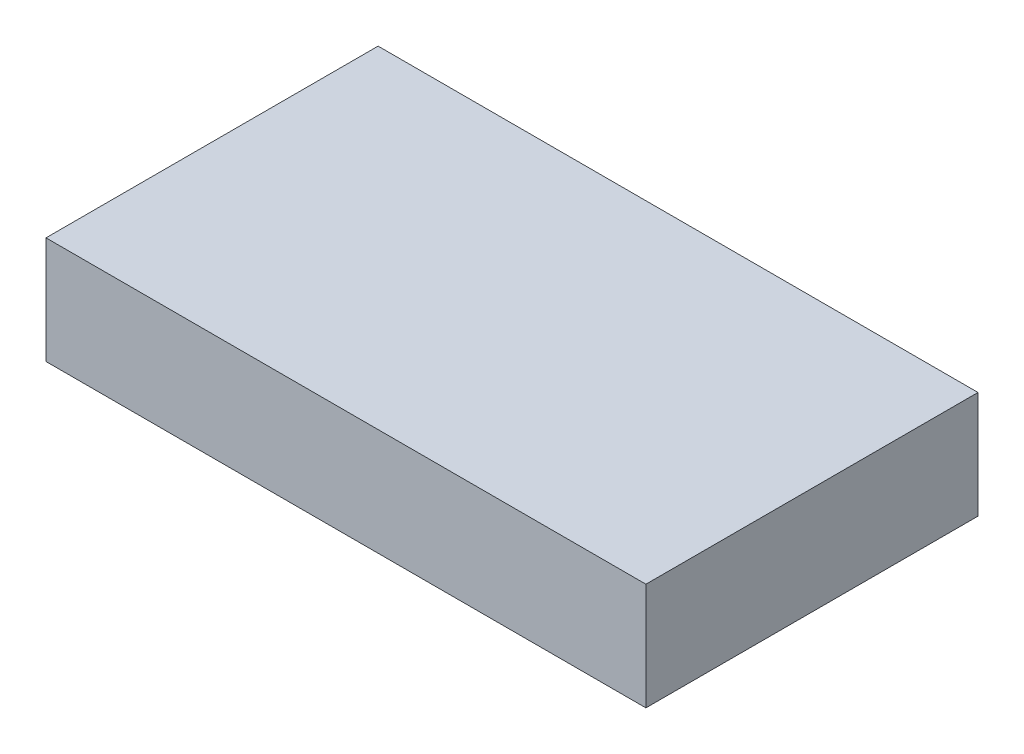
ISO-10303-21;
HEADER;
FILE_DESCRIPTION(('STEP AP214'),'2;1');
FILE_NAME('part.step','',(''),(''),'','','');
FILE_SCHEMA(('AUTOMOTIVE_DESIGN { 1 0 10303 214 1 1 1 1 }'));
ENDSEC;
DATA;
#1=APPLICATION_CONTEXT('core data for automotive mechanical design processes');
#2=APPLICATION_PROTOCOL_DEFINITION('international standard','automotive_design',2000,#1);
#3=PRODUCT_CONTEXT('',#1,'mechanical');
#4=PRODUCT('Part','Part','',(#3));
#5=PRODUCT_RELATED_PRODUCT_CATEGORY('part','',(#4));
#6=PRODUCT_DEFINITION_FORMATION('','',#4);
#7=PRODUCT_DEFINITION_CONTEXT('part definition',#1,'design');
#8=PRODUCT_DEFINITION('design','',#6,#7);
#9=PRODUCT_DEFINITION_SHAPE('','',#8);
#10=(LENGTH_UNIT() NAMED_UNIT(*) SI_UNIT(.MILLI.,.METRE.));
#11=(NAMED_UNIT(*) PLANE_ANGLE_UNIT() SI_UNIT($,.RADIAN.));
#12=(NAMED_UNIT(*) SI_UNIT($,.STERADIAN.) SOLID_ANGLE_UNIT());
#13=UNCERTAINTY_MEASURE_WITH_UNIT(LENGTH_MEASURE(1.E-05),#10,'distance_accuracy_value','');
#14=(GEOMETRIC_REPRESENTATION_CONTEXT(3) GLOBAL_UNCERTAINTY_ASSIGNED_CONTEXT((#13)) GLOBAL_UNIT_ASSIGNED_CONTEXT((#10,
#11,#12)) REPRESENTATION_CONTEXT('',''));
#15=CARTESIAN_POINT('',(0.,0.,0.));
#16=DIRECTION('',(0.,0.,1.));
#17=DIRECTION('',(1.,0.,0.));
#18=AXIS2_PLACEMENT_3D('',#15,#16,#17);
#19=CARTESIAN_POINT('',(28.,10.,15.5));
#20=DIRECTION('',(-1.,0.,0.));
#21=DIRECTION('',(0.,0.,1.));
#22=AXIS2_PLACEMENT_3D('',#19,#20,#21);
#23=PLANE('',#22);
#24=DIRECTION('',(0.,0.,-1.));
#25=VECTOR('',#24,1.);
#26=CARTESIAN_POINT('',(28.,0.,15.5));
#27=LINE('',#26,#25);
#28=CARTESIAN_POINT('',(28.,0.,15.5));
#29=VERTEX_POINT('',#28);
#30=CARTESIAN_POINT('',(28.,0.,-15.5));
#31=VERTEX_POINT('',#30);
#32=EDGE_CURVE('E96',#29,#31,#27,.T.);
#33=ORIENTED_EDGE('',*,*,#32,.T.);
#34=DIRECTION('',(0.,-1.,0.));
#35=VECTOR('',#34,1.);
#36=CARTESIAN_POINT('',(28.,10.,-15.5));
#37=LINE('',#36,#35);
#38=CARTESIAN_POINT('',(28.,10.,-15.5));
#39=VERTEX_POINT('',#38);
#40=EDGE_CURVE('E11',#39,#31,#37,.T.);
#41=ORIENTED_EDGE('',*,*,#40,.F.);
#42=DIRECTION('',(0.,0.,-1.));
#43=VECTOR('',#42,1.);
#44=CARTESIAN_POINT('',(28.,10.,15.5));
#45=LINE('',#44,#43);
#46=CARTESIAN_POINT('',(28.,10.,15.5));
#47=VERTEX_POINT('',#46);
#48=EDGE_CURVE('E84',#47,#39,#45,.T.);
#49=ORIENTED_EDGE('',*,*,#48,.F.);
#50=DIRECTION('',(0.,-1.,0.));
#51=VECTOR('',#50,1.);
#52=CARTESIAN_POINT('',(28.,10.,15.5));
#53=LINE('',#52,#51);
#54=EDGE_CURVE('E92',#47,#29,#53,.T.);
#55=ORIENTED_EDGE('',*,*,#54,.T.);
#56=EDGE_LOOP('',(#33,#41,#49,#55));
#57=FACE_BOUND('',#56,.T.);
#58=ADVANCED_FACE('F33',(#57),#23,.F.);
#59=CARTESIAN_POINT('',(-28.,10.,-15.5));
#60=DIRECTION('',(0.,0.,1.));
#61=DIRECTION('',(1.,0.,0.));
#62=AXIS2_PLACEMENT_3D('',#59,#60,#61);
#63=PLANE('',#62);
#64=DIRECTION('',(-1.,0.,0.));
#65=VECTOR('',#64,1.);
#66=CARTESIAN_POINT('',(-28.,0.,-15.5));
#67=LINE('',#66,#65);
#68=CARTESIAN_POINT('',(-28.,0.,-15.5));
#69=VERTEX_POINT('',#68);
#70=EDGE_CURVE('E88',#31,#69,#67,.T.);
#71=ORIENTED_EDGE('',*,*,#70,.T.);
#72=DIRECTION('',(0.,-1.,0.));
#73=VECTOR('',#72,1.);
#74=CARTESIAN_POINT('',(-28.,10.,-15.5));
#75=LINE('',#74,#73);
#76=CARTESIAN_POINT('',(-28.,10.,-15.5));
#77=VERTEX_POINT('',#76);
#78=EDGE_CURVE('E41',#77,#69,#75,.T.);
#79=ORIENTED_EDGE('',*,*,#78,.F.);
#80=DIRECTION('',(-1.,0.,0.));
#81=VECTOR('',#80,1.);
#82=CARTESIAN_POINT('',(-28.,10.,-15.5));
#83=LINE('',#82,#81);
#84=EDGE_CURVE('E79',#39,#77,#83,.T.);
#85=ORIENTED_EDGE('',*,*,#84,.F.);
#86=ORIENTED_EDGE('',*,*,#40,.T.);
#87=EDGE_LOOP('',(#71,#79,#85,#86));
#88=FACE_BOUND('',#87,.T.);
#89=ADVANCED_FACE('F87',(#88),#63,.F.);
#90=CARTESIAN_POINT('',(-28.,10.,15.5));
#91=DIRECTION('',(1.,0.,0.));
#92=DIRECTION('',(0.,0.,-1.));
#93=AXIS2_PLACEMENT_3D('',#90,#91,#92);
#94=PLANE('',#93);
#95=DIRECTION('',(0.,0.,1.));
#96=VECTOR('',#95,1.);
#97=CARTESIAN_POINT('',(-28.,0.,15.5));
#98=LINE('',#97,#96);
#99=CARTESIAN_POINT('',(-28.,0.,15.5));
#100=VERTEX_POINT('',#99);
#101=EDGE_CURVE('E66',#69,#100,#98,.T.);
#102=ORIENTED_EDGE('',*,*,#101,.T.);
#103=DIRECTION('',(0.,-1.,0.));
#104=VECTOR('',#103,1.);
#105=CARTESIAN_POINT('',(-28.,10.,15.5));
#106=LINE('',#105,#104);
#107=CARTESIAN_POINT('',(-28.,10.,15.5));
#108=VERTEX_POINT('',#107);
#109=EDGE_CURVE('E89',#108,#100,#106,.T.);
#110=ORIENTED_EDGE('',*,*,#109,.F.);
#111=DIRECTION('',(0.,0.,1.));
#112=VECTOR('',#111,1.);
#113=CARTESIAN_POINT('',(-28.,10.,15.5));
#114=LINE('',#113,#112);
#115=EDGE_CURVE('E82',#77,#108,#114,.T.);
#116=ORIENTED_EDGE('',*,*,#115,.F.);
#117=ORIENTED_EDGE('',*,*,#78,.T.);
#118=EDGE_LOOP('',(#102,#110,#116,#117));
#119=FACE_BOUND('',#118,.T.);
#120=ADVANCED_FACE('F90',(#119),#94,.F.);
#121=CARTESIAN_POINT('',(-28.,10.,15.5));
#122=DIRECTION('',(0.,0.,-1.));
#123=DIRECTION('',(-1.,0.,0.));
#124=AXIS2_PLACEMENT_3D('',#121,#122,#123);
#125=PLANE('',#124);
#126=DIRECTION('',(1.,0.,0.));
#127=VECTOR('',#126,1.);
#128=CARTESIAN_POINT('',(-28.,0.,15.5));
#129=LINE('',#128,#127);
#130=EDGE_CURVE('E72',#100,#29,#129,.T.);
#131=ORIENTED_EDGE('',*,*,#130,.T.);
#132=ORIENTED_EDGE('',*,*,#54,.F.);
#133=DIRECTION('',(1.,0.,0.));
#134=VECTOR('',#133,1.);
#135=CARTESIAN_POINT('',(-28.,10.,15.5));
#136=LINE('',#135,#134);
#137=EDGE_CURVE('E49',#108,#47,#136,.T.);
#138=ORIENTED_EDGE('',*,*,#137,.F.);
#139=ORIENTED_EDGE('',*,*,#109,.T.);
#140=EDGE_LOOP('',(#131,#132,#138,#139));
#141=FACE_BOUND('',#140,.T.);
#142=ADVANCED_FACE('F103',(#141),#125,.F.);
#143=CARTESIAN_POINT('',(28.,10.,-15.5));
#144=DIRECTION('',(0.,-1.,0.));
#145=DIRECTION('',(0.,0.,-1.));
#146=AXIS2_PLACEMENT_3D('',#143,#144,#145);
#147=PLANE('',#146);
#148=ORIENTED_EDGE('',*,*,#48,.T.);
#149=ORIENTED_EDGE('',*,*,#84,.T.);
#150=ORIENTED_EDGE('',*,*,#115,.T.);
#151=ORIENTED_EDGE('',*,*,#137,.T.);
#152=EDGE_LOOP('',(#148,#149,#150,#151));
#153=FACE_BOUND('',#152,.T.);
#154=ADVANCED_FACE('F80',(#153),#147,.F.);
#155=CARTESIAN_POINT('',(28.,0.,-15.5));
#156=DIRECTION('',(0.,-1.,0.));
#157=DIRECTION('',(0.,0.,-1.));
#158=AXIS2_PLACEMENT_3D('',#155,#156,#157);
#159=PLANE('',#158);
#160=ORIENTED_EDGE('',*,*,#32,.F.);
#161=ORIENTED_EDGE('',*,*,#130,.F.);
#162=ORIENTED_EDGE('',*,*,#101,.F.);
#163=ORIENTED_EDGE('',*,*,#70,.F.);
#164=EDGE_LOOP('',(#160,#161,#162,#163));
#165=FACE_BOUND('',#164,.T.);
#166=ADVANCED_FACE('F106',(#165),#159,.T.);
#167=CLOSED_SHELL('',(#58,#89,#120,#142,#154,#166));
#168=MANIFOLD_SOLID_BREP('B2',#167);
#169=ADVANCED_BREP_SHAPE_REPRESENTATION('',(#18,#168),#14);
#170=SHAPE_DEFINITION_REPRESENTATION(#9,#169);
ENDSEC;
END-ISO-10303-21;
